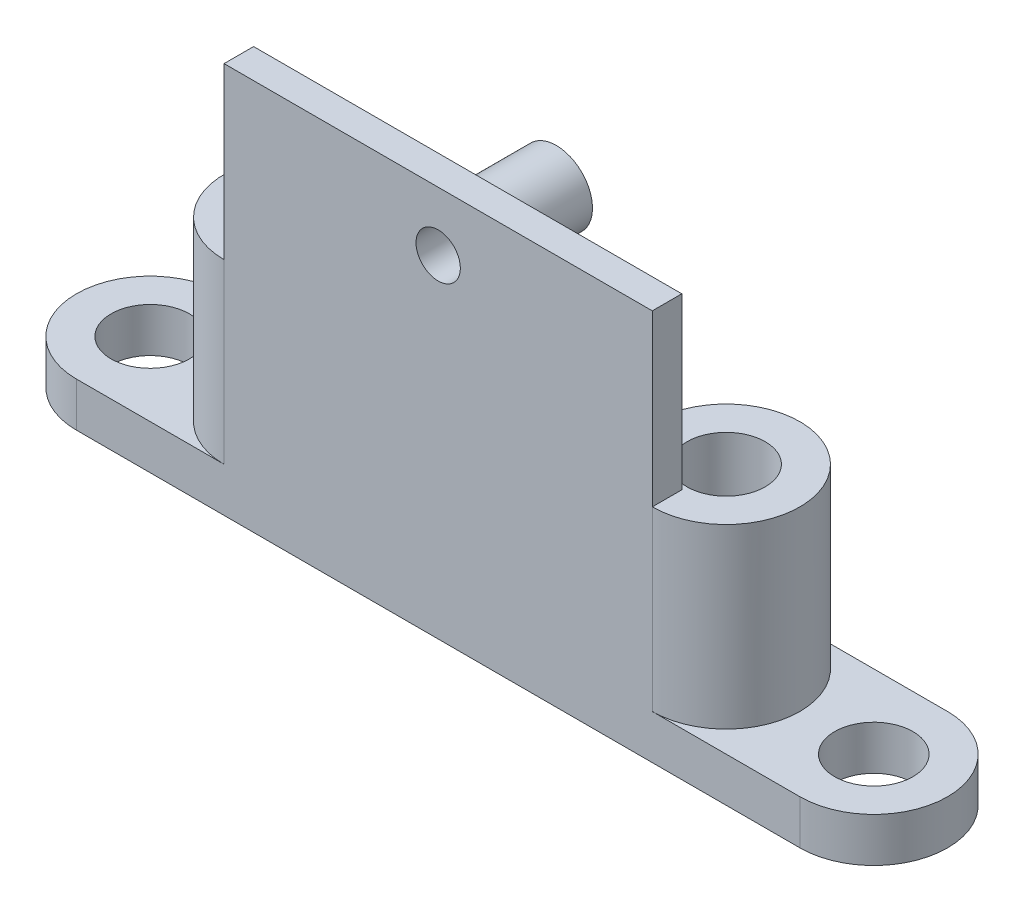
ISO-10303-21;
HEADER;
FILE_DESCRIPTION(('STEP AP214'),'2;1');
FILE_NAME('part.step','',(''),(''),'','','');
FILE_SCHEMA(('AUTOMOTIVE_DESIGN { 1 0 10303 214 1 1 1 1 }'));
ENDSEC;
DATA;
#1=APPLICATION_CONTEXT('core data for automotive mechanical design processes');
#2=APPLICATION_PROTOCOL_DEFINITION('international standard','automotive_design',2000,#1);
#3=PRODUCT_CONTEXT('',#1,'mechanical');
#4=PRODUCT('Part','Part','',(#3));
#5=PRODUCT_RELATED_PRODUCT_CATEGORY('part','',(#4));
#6=PRODUCT_DEFINITION_FORMATION('','',#4);
#7=PRODUCT_DEFINITION_CONTEXT('part definition',#1,'design');
#8=PRODUCT_DEFINITION('design','',#6,#7);
#9=PRODUCT_DEFINITION_SHAPE('','',#8);
#10=(LENGTH_UNIT() NAMED_UNIT(*) SI_UNIT(.MILLI.,.METRE.));
#11=(NAMED_UNIT(*) PLANE_ANGLE_UNIT() SI_UNIT($,.RADIAN.));
#12=(NAMED_UNIT(*) SI_UNIT($,.STERADIAN.) SOLID_ANGLE_UNIT());
#13=UNCERTAINTY_MEASURE_WITH_UNIT(LENGTH_MEASURE(1.E-05),#10,'distance_accuracy_value','');
#14=(GEOMETRIC_REPRESENTATION_CONTEXT(3) GLOBAL_UNCERTAINTY_ASSIGNED_CONTEXT((#13)) GLOBAL_UNIT_ASSIGNED_CONTEXT((#10,
#11,#12)) REPRESENTATION_CONTEXT('',''));
#15=CARTESIAN_POINT('',(0.,0.,0.));
#16=DIRECTION('',(0.,0.,1.));
#17=DIRECTION('',(1.,0.,0.));
#18=AXIS2_PLACEMENT_3D('',#15,#16,#17);
#19=CARTESIAN_POINT('',(5.00000000000012,10.,-5.));
#20=DIRECTION('',(0.,1.,0.));
#21=DIRECTION('',(0.,0.,1.));
#22=AXIS2_PLACEMENT_3D('',#19,#20,#21);
#23=PLANE('',#22);
#24=CARTESIAN_POINT('',(5.00000000000012,10.,-5.));
#25=DIRECTION('',(0.,-1.,0.));
#26=DIRECTION('',(0.,0.,1.));
#27=AXIS2_PLACEMENT_3D('',#24,#25,#26);
#28=CIRCLE('',#27,5.);
#29=CARTESIAN_POINT('',(5.00000000000012,10.,-10.));
#30=VERTEX_POINT('',#29);
#31=CARTESIAN_POINT('',(9.89897948556648,10.,-4.));
#32=VERTEX_POINT('',#31);
#33=EDGE_CURVE('E254',#30,#32,#28,.T.);
#34=ORIENTED_EDGE('',*,*,#33,.T.);
#35=DIRECTION('',(1.,0.,0.));
#36=VECTOR('',#35,1.);
#37=CARTESIAN_POINT('',(30.0000000000001,10.,-4.));
#38=LINE('',#37,#36);
#39=CARTESIAN_POINT('',(29.1010205144338,10.,-4.));
#40=VERTEX_POINT('',#39);
#41=EDGE_CURVE('E298',#32,#40,#38,.T.);
#42=ORIENTED_EDGE('',*,*,#41,.T.);
#43=CARTESIAN_POINT('',(34.0000000000001,10.,-5.));
#44=DIRECTION('',(0.,-1.,0.));
#45=DIRECTION('',(0.,0.,1.));
#46=AXIS2_PLACEMENT_3D('',#43,#44,#45);
#47=CIRCLE('',#46,5.);
#48=CARTESIAN_POINT('',(34.0000000000001,10.,-10.));
#49=VERTEX_POINT('',#48);
#50=EDGE_CURVE('E257',#40,#49,#47,.T.);
#51=ORIENTED_EDGE('',*,*,#50,.T.);
#52=DIRECTION('',(-1.,0.,0.));
#53=VECTOR('',#52,1.);
#54=CARTESIAN_POINT('',(5.00000000000012,10.,-10.));
#55=LINE('',#54,#53);
#56=EDGE_CURVE('E259',#49,#30,#55,.T.);
#57=ORIENTED_EDGE('',*,*,#56,.T.);
#58=EDGE_LOOP('',(#34,#42,#51,#57));
#59=FACE_BOUND('',#58,.T.);
#60=ADVANCED_FACE('F39',(#59),#23,.T.);
#61=CARTESIAN_POINT('',(34.0000000000001,15.,-5.));
#62=DIRECTION('',(0.,-1.,0.));
#63=DIRECTION('',(0.,0.,-1.));
#64=AXIS2_PLACEMENT_3D('',#61,#62,#63);
#65=CYLINDRICAL_SURFACE('',#64,5.);
#66=ORIENTED_EDGE('',*,*,#50,.F.);
#67=CARTESIAN_POINT('',(29.1010205144338,10.,-4.));
#68=CARTESIAN_POINT('',(29.1126902135662,9.99999307281817,-3.94278294499893));
#69=CARTESIAN_POINT('',(29.1253776267007,10.0024549159808,-3.88578862192964));
#70=CARTESIAN_POINT('',(29.1526214576939,10.0121509153291,-3.77269515352069));
#71=CARTESIAN_POINT('',(29.1671766959664,10.019382071384,-3.71659546811674));
#72=CARTESIAN_POINT('',(29.1979299396638,10.0384055503466,-3.60593746735619));
#73=CARTESIAN_POINT('',(29.2141196212744,10.0501755451099,-3.5513729881278));
#74=CARTESIAN_POINT('',(29.2479905125589,10.0780764625006,-3.44385465736229));
#75=CARTESIAN_POINT('',(29.2656719293214,10.0942079913009,-3.39090103084301));
#76=CARTESIAN_POINT('',(29.3205323872584,10.1487587882031,-3.23516726086207));
#77=CARTESIAN_POINT('',(29.3596264444344,10.193396195741,-3.13516458121287));
#78=CARTESIAN_POINT('',(29.4408392590147,10.2976812106451,-2.94455878628707));
#79=CARTESIAN_POINT('',(29.4829629370559,10.3573536497374,-2.85397157460503));
#80=CARTESIAN_POINT('',(29.5713339220482,10.4957844297533,-2.67674954081887));
#81=CARTESIAN_POINT('',(29.6176361817495,10.5757063940903,-2.59104755291779));
#82=CARTESIAN_POINT('',(29.7075491174569,10.7501227208773,-2.43425749110638));
#83=CARTESIAN_POINT('',(29.7511605231809,10.8446131080609,-2.36316544290965));
#84=CARTESIAN_POINT('',(29.8251643273312,11.0306003727889,-2.24778697309176));
#85=CARTESIAN_POINT('',(29.8565555378921,11.1201656478167,-2.20103286488032));
#86=CARTESIAN_POINT('',(29.9116882264867,11.3071664048664,-2.12109876649629));
#87=CARTESIAN_POINT('',(29.9354511971795,11.4045787899909,-2.08788056622036));
#88=CARTESIAN_POINT('',(29.9688564229424,11.584660118699,-2.04187205488796));
#89=CARTESIAN_POINT('',(29.980394866039,11.6662572508572,-2.0262898967322));
#90=CARTESIAN_POINT('',(29.9920824636055,11.7903309818029,-2.01057928644068));
#91=CARTESIAN_POINT('',(29.9950419897803,11.8320924229655,-2.00661927814956));
#92=CARTESIAN_POINT('',(29.999004261332,11.9158971864172,-2.00132726954565));
#93=CARTESIAN_POINT('',(30.0000058930954,11.9579406554861,-1.99999676484028));
#94=CARTESIAN_POINT('',(30.0000000000001,12.,-2.));
#95=B_SPLINE_CURVE_WITH_KNOTS('',3,(#67,#68,#69,#70,#71,#72,#73,#74,#75,#76,#77,#78,#79,#80,#81,
#82,#83,#84,#85,#86,#87,#88,#89,#90,#91,#92,#93,#94),.UNSPECIFIED.,.F.,.F.,(4,2,2,2,2,2,2,2,2,2,
2,2,2,4),(0.,0.175101370517457,0.350092698637755,0.52423394384886,0.698399403942051,
1.04563798829342,1.39345387180364,1.76978381212137,2.14601124493038,2.46215827511096,
2.77740657571168,3.02802320134718,3.15406643430614,3.28018133744859),.UNSPECIFIED.);
#96=CARTESIAN_POINT('',(30.0000000000001,12.,-2.));
#97=VERTEX_POINT('',#96);
#98=EDGE_CURVE('E67',#40,#97,#95,.T.);
#99=ORIENTED_EDGE('',*,*,#98,.T.);
#100=DIRECTION('',(0.,-1.,0.));
#101=VECTOR('',#100,1.);
#102=CARTESIAN_POINT('',(30.0000000000001,15.,-2.));
#103=LINE('',#102,#101);
#104=CARTESIAN_POINT('',(30.0000000000001,15.,-2.));
#105=VERTEX_POINT('',#104);
#106=EDGE_CURVE('E182',#97,#105,#103,.F.);
#107=ORIENTED_EDGE('',*,*,#106,.T.);
#108=CARTESIAN_POINT('',(34.0000000000001,15.,-5.));
#109=DIRECTION('',(0.,1.,0.));
#110=DIRECTION('',(0.,0.,1.));
#111=AXIS2_PLACEMENT_3D('',#108,#109,#110);
#112=CIRCLE('',#111,5.);
#113=CARTESIAN_POINT('',(34.0000000000001,15.,0.));
#114=VERTEX_POINT('',#113);
#115=EDGE_CURVE('E271',#114,#105,#112,.T.);
#116=ORIENTED_EDGE('',*,*,#115,.F.);
#117=DIRECTION('',(0.,-1.,0.));
#118=VECTOR('',#117,1.);
#119=CARTESIAN_POINT('',(34.0000000000001,15.,0.));
#120=LINE('',#119,#118);
#121=CARTESIAN_POINT('',(34.0000000000001,3.,0.));
#122=VERTEX_POINT('',#121);
#123=EDGE_CURVE('E278',#114,#122,#120,.T.);
#124=ORIENTED_EDGE('',*,*,#123,.T.);
#125=CARTESIAN_POINT('',(34.0000000000001,3.,-5.));
#126=DIRECTION('',(0.,-1.,0.));
#127=DIRECTION('',(0.,0.,-1.));
#128=AXIS2_PLACEMENT_3D('',#125,#126,#127);
#129=CIRCLE('',#128,5.);
#130=CARTESIAN_POINT('',(34.0000000000001,3.,-10.));
#131=VERTEX_POINT('',#130);
#132=EDGE_CURVE('E243',#131,#122,#129,.T.);
#133=ORIENTED_EDGE('',*,*,#132,.F.);
#134=DIRECTION('',(0.,-1.,0.));
#135=VECTOR('',#134,1.);
#136=CARTESIAN_POINT('',(34.0000000000001,15.,-10.));
#137=LINE('',#136,#135);
#138=EDGE_CURVE('E287',#49,#131,#137,.T.);
#139=ORIENTED_EDGE('',*,*,#138,.F.);
#140=EDGE_LOOP('',(#66,#99,#107,#116,#124,#133,#139));
#141=FACE_BOUND('',#140,.T.);
#142=ADVANCED_FACE('F305',(#141),#65,.T.);
#143=CARTESIAN_POINT('',(5.00000000000012,15.,-5.));
#144=DIRECTION('',(0.,-1.,0.));
#145=DIRECTION('',(0.,0.,-1.));
#146=AXIS2_PLACEMENT_3D('',#143,#144,#145);
#147=CYLINDRICAL_SURFACE('',#146,5.);
#148=DIRECTION('',(0.,-1.,0.));
#149=VECTOR('',#148,1.);
#150=CARTESIAN_POINT('',(9.00000000000012,15.,-2.));
#151=LINE('',#150,#149);
#152=CARTESIAN_POINT('',(9.00000000000012,15.,-2.));
#153=VERTEX_POINT('',#152);
#154=CARTESIAN_POINT('',(9.00000000000012,12.,-2.));
#155=VERTEX_POINT('',#154);
#156=EDGE_CURVE('E186',#153,#155,#151,.T.);
#157=ORIENTED_EDGE('',*,*,#156,.T.);
#158=CARTESIAN_POINT('',(9.00000000000012,12.,-2.));
#159=CARTESIAN_POINT('',(8.99998359957867,11.9501118086645,-1.99998912999715));
#160=CARTESIAN_POINT('',(9.00139950338209,11.9002339130368,-2.00186621290167));
#161=CARTESIAN_POINT('',(9.00697117565529,11.8009478282955,-2.00931094460478));
#162=CARTESIAN_POINT('',(9.01112471434834,11.7515392900896,-2.01487558993992));
#163=CARTESIAN_POINT('',(9.0220064150729,11.6539251721464,-2.02955522325891));
#164=CARTESIAN_POINT('',(9.02871507660948,11.605713356963,-2.03864332966506));
#165=CARTESIAN_POINT('',(9.04448850864633,11.5104582688436,-2.06022255242272));
#166=CARTESIAN_POINT('',(9.05355364955244,11.4634151808902,-2.07271420377912));
#167=CARTESIAN_POINT('',(9.08384132615853,11.32477470574,-2.11496224326767));
#168=CARTESIAN_POINT('',(9.10820217945941,11.2352823971424,-2.14955119611212));
#169=CARTESIAN_POINT('',(9.1630109805843,11.0635696843813,-2.23021457133599));
#170=CARTESIAN_POINT('',(9.1934708173822,10.9813639429227,-2.27631147058523));
#171=CARTESIAN_POINT('',(9.26171424848732,10.8168018979709,-2.38422352335028));
#172=CARTESIAN_POINT('',(9.29993349194095,10.7353873996464,-2.44719831808205));
#173=CARTESIAN_POINT('',(9.37840049696802,10.5836252938915,-2.58424865442774));
#174=CARTESIAN_POINT('',(9.41864941398518,10.5132840863005,-2.65833056749726));
#175=CARTESIAN_POINT('',(9.50525583892261,10.3743542697641,-2.82900863539251));
#176=CARTESIAN_POINT('',(9.55156859360123,10.3078171590678,-2.92731192248441));
#177=CARTESIAN_POINT('',(9.6406358204123,10.1927037814334,-3.13525515260118));
#178=CARTESIAN_POINT('',(9.68339432275204,10.144106950456,-3.24488193037178));
#179=CARTESIAN_POINT('',(9.75821917327529,10.0712504979287,-3.46025447044488));
#180=CARTESIAN_POINT('',(9.79094772412948,10.0448616604007,-3.56503951966061));
#181=CARTESIAN_POINT('',(9.83523885001318,10.0181351468716,-3.72579908375654));
#182=CARTESIAN_POINT('',(9.84922620584665,10.011368510852,-3.78009868430475));
#183=CARTESIAN_POINT('',(9.87545056064214,10.00229854344,-3.88952327754802));
#184=CARTESIAN_POINT('',(9.88768642333513,9.9999980974111,-3.94464878065877));
#185=CARTESIAN_POINT('',(9.89897948556648,10.,-4.));
#186=B_SPLINE_CURVE_WITH_KNOTS('',3,(#158,#159,#160,#161,#162,#163,#164,#165,#166,#167,#168,
#169,#170,#171,#172,#173,#174,#175,#176,#177,#178,#179,#180,#181,#182,#183,#184,#185),
.UNSPECIFIED.,.F.,.F.,(4,2,2,2,2,2,2,2,2,2,2,2,2,4),(0.,0.149592447049756,0.299063202836386,
0.447415355023448,0.595790840223872,0.891383802035521,1.18755868430084,1.51570729760843,
1.84404487449678,2.22451374151765,2.60454513206277,2.94164309833685,3.11089389563732,
3.28025400036889),.UNSPECIFIED.);
#187=EDGE_CURVE('E11',#155,#32,#186,.T.);
#188=ORIENTED_EDGE('',*,*,#187,.T.);
#189=ORIENTED_EDGE('',*,*,#33,.F.);
#190=DIRECTION('',(0.,-1.,0.));
#191=VECTOR('',#190,1.);
#192=CARTESIAN_POINT('',(5.00000000000012,15.,-10.));
#193=LINE('',#192,#191);
#194=CARTESIAN_POINT('',(5.00000000000012,3.,-10.));
#195=VERTEX_POINT('',#194);
#196=EDGE_CURVE('E285',#30,#195,#193,.T.);
#197=ORIENTED_EDGE('',*,*,#196,.T.);
#198=CARTESIAN_POINT('',(5.00000000000012,3.,-5.));
#199=DIRECTION('',(0.,-1.,0.));
#200=DIRECTION('',(0.,0.,-1.));
#201=AXIS2_PLACEMENT_3D('',#198,#199,#200);
#202=CIRCLE('',#201,5.);
#203=CARTESIAN_POINT('',(5.00000000000012,3.,0.));
#204=VERTEX_POINT('',#203);
#205=EDGE_CURVE('E290',#204,#195,#202,.T.);
#206=ORIENTED_EDGE('',*,*,#205,.F.);
#207=DIRECTION('',(0.,-1.,0.));
#208=VECTOR('',#207,1.);
#209=CARTESIAN_POINT('',(5.00000000000012,15.,0.));
#210=LINE('',#209,#208);
#211=CARTESIAN_POINT('',(5.00000000000012,15.,0.));
#212=VERTEX_POINT('',#211);
#213=EDGE_CURVE('E282',#212,#204,#210,.T.);
#214=ORIENTED_EDGE('',*,*,#213,.F.);
#215=CARTESIAN_POINT('',(5.00000000000012,15.,-5.));
#216=DIRECTION('',(0.,1.,0.));
#217=DIRECTION('',(0.,0.,1.));
#218=AXIS2_PLACEMENT_3D('',#215,#216,#217);
#219=CIRCLE('',#218,5.);
#220=EDGE_CURVE('E274',#153,#212,#219,.T.);
#221=ORIENTED_EDGE('',*,*,#220,.F.);
#222=EDGE_LOOP('',(#157,#188,#189,#197,#206,#214,#221));
#223=FACE_BOUND('',#222,.T.);
#224=ADVANCED_FACE('F309',(#223),#147,.T.);
#225=CARTESIAN_POINT('',(34.0000000000001,15.,-5.));
#226=DIRECTION('',(0.,1.,0.));
#227=DIRECTION('',(0.,0.,1.));
#228=AXIS2_PLACEMENT_3D('',#225,#226,#227);
#229=PLANE('',#228);
#230=DIRECTION('',(0.,0.,1.));
#231=VECTOR('',#230,1.);
#232=CARTESIAN_POINT('',(5.00000000000012,15.,-5.));
#233=LINE('',#232,#231);
#234=CARTESIAN_POINT('',(5.00000000000012,15.,-2.));
#235=VERTEX_POINT('',#234);
#236=EDGE_CURVE('E188',#235,#212,#233,.T.);
#237=ORIENTED_EDGE('',*,*,#236,.F.);
#238=DIRECTION('',(-1.,0.,0.));
#239=VECTOR('',#238,1.);
#240=CARTESIAN_POINT('',(34.0000000000001,15.,-2.));
#241=LINE('',#240,#239);
#242=EDGE_CURVE('E184',#153,#235,#241,.T.);
#243=ORIENTED_EDGE('',*,*,#242,.F.);
#244=ORIENTED_EDGE('',*,*,#220,.T.);
#245=EDGE_LOOP('',(#237,#243,#244));
#246=FACE_BOUND('',#245,.T.);
#247=CARTESIAN_POINT('',(5.00000000000012,15.,-5.));
#248=DIRECTION('',(0.,1.,0.));
#249=DIRECTION('',(0.,0.,1.));
#250=AXIS2_PLACEMENT_3D('',#247,#248,#249);
#251=CIRCLE('',#250,2.65);
#252=CARTESIAN_POINT('',(5.00000000000012,15.,-2.35));
#253=VERTEX_POINT('',#252);
#254=EDGE_CURVE('E266',#253,#253,#251,.T.);
#255=ORIENTED_EDGE('',*,*,#254,.F.);
#256=EDGE_LOOP('',(#255));
#257=FACE_BOUND('',#256,.T.);
#258=ADVANCED_FACE('F313',(#246,#257),#229,.T.);
#259=CARTESIAN_POINT('',(5.00000000000012,15.,-10.));
#260=DIRECTION('',(0.,0.,1.));
#261=DIRECTION('',(1.,0.,0.));
#262=AXIS2_PLACEMENT_3D('',#259,#260,#261);
#263=PLANE('',#262);
#264=DIRECTION('',(-1.,0.,0.));
#265=VECTOR('',#264,1.);
#266=CARTESIAN_POINT('',(5.00000000000012,0.,-10.));
#267=LINE('',#266,#265);
#268=CARTESIAN_POINT('',(44.0018614213481,0.,-10.));
#269=VERTEX_POINT('',#268);
#270=CARTESIAN_POINT('',(-5.00186142134788,0.,-10.));
#271=VERTEX_POINT('',#270);
#272=EDGE_CURVE('E270',#269,#271,#267,.T.);
#273=ORIENTED_EDGE('',*,*,#272,.T.);
#274=DIRECTION('',(0.,-1.,0.));
#275=VECTOR('',#274,1.);
#276=CARTESIAN_POINT('',(-5.00186142134788,3.,-10.));
#277=LINE('',#276,#275);
#278=CARTESIAN_POINT('',(-5.00186142134788,3.,-10.));
#279=VERTEX_POINT('',#278);
#280=EDGE_CURVE('E244',#279,#271,#277,.T.);
#281=ORIENTED_EDGE('',*,*,#280,.F.);
#282=DIRECTION('',(1.,0.,0.));
#283=VECTOR('',#282,1.);
#284=CARTESIAN_POINT('',(44.0018614213481,3.,-10.));
#285=LINE('',#284,#283);
#286=EDGE_CURVE('E232',#279,#195,#285,.T.);
#287=ORIENTED_EDGE('',*,*,#286,.T.);
#288=ORIENTED_EDGE('',*,*,#196,.F.);
#289=ORIENTED_EDGE('',*,*,#56,.F.);
#290=ORIENTED_EDGE('',*,*,#138,.T.);
#291=CARTESIAN_POINT('',(44.0018614213481,3.,-10.));
#292=VERTEX_POINT('',#291);
#293=EDGE_CURVE('E231',#131,#292,#285,.T.);
#294=ORIENTED_EDGE('',*,*,#293,.T.);
#295=DIRECTION('',(0.,-1.,0.));
#296=VECTOR('',#295,1.);
#297=CARTESIAN_POINT('',(44.0018614213481,3.,-10.));
#298=LINE('',#297,#296);
#299=EDGE_CURVE('E240',#292,#269,#298,.T.);
#300=ORIENTED_EDGE('',*,*,#299,.T.);
#301=EDGE_LOOP('',(#273,#281,#287,#288,#289,#290,#294,#300));
#302=FACE_BOUND('',#301,.T.);
#303=ADVANCED_FACE('F310',(#302),#263,.F.);
#304=CARTESIAN_POINT('',(5.00000000000012,15.,0.));
#305=DIRECTION('',(0.,0.,-1.));
#306=DIRECTION('',(-1.,0.,0.));
#307=AXIS2_PLACEMENT_3D('',#304,#305,#306);
#308=PLANE('',#307);
#309=ORIENTED_EDGE('',*,*,#123,.F.);
#310=DIRECTION('',(0.,1.,0.));
#311=VECTOR('',#310,1.);
#312=CARTESIAN_POINT('',(34.0000000000001,10.,0.));
#313=LINE('',#312,#311);
#314=CARTESIAN_POINT('',(34.0000000000001,26.5,0.));
#315=VERTEX_POINT('',#314);
#316=EDGE_CURVE('E174',#114,#315,#313,.T.);
#317=ORIENTED_EDGE('',*,*,#316,.T.);
#318=DIRECTION('',(1.,0.,0.));
#319=VECTOR('',#318,1.);
#320=CARTESIAN_POINT('',(29.5000000000001,26.5,0.));
#321=LINE('',#320,#319);
#322=CARTESIAN_POINT('',(5.00000000000012,26.5,0.));
#323=VERTEX_POINT('',#322);
#324=EDGE_CURVE('E161',#323,#315,#321,.T.);
#325=ORIENTED_EDGE('',*,*,#324,.F.);
#326=DIRECTION('',(0.,-1.,0.));
#327=VECTOR('',#326,1.);
#328=CARTESIAN_POINT('',(5.00000000000012,10.,0.));
#329=LINE('',#328,#327);
#330=EDGE_CURVE('E171',#323,#212,#329,.T.);
#331=ORIENTED_EDGE('',*,*,#330,.T.);
#332=ORIENTED_EDGE('',*,*,#213,.T.);
#333=DIRECTION('',(-1.,0.,0.));
#334=VECTOR('',#333,1.);
#335=CARTESIAN_POINT('',(44.0018614213481,3.,0.));
#336=LINE('',#335,#334);
#337=CARTESIAN_POINT('',(-5.00186142134788,3.,0.));
#338=VERTEX_POINT('',#337);
#339=EDGE_CURVE('E223',#204,#338,#336,.T.);
#340=ORIENTED_EDGE('',*,*,#339,.T.);
#341=DIRECTION('',(0.,-1.,0.));
#342=VECTOR('',#341,1.);
#343=CARTESIAN_POINT('',(-5.00186142134788,3.,0.));
#344=LINE('',#343,#342);
#345=CARTESIAN_POINT('',(-5.00186142134788,0.,0.));
#346=VERTEX_POINT('',#345);
#347=EDGE_CURVE('E247',#338,#346,#344,.T.);
#348=ORIENTED_EDGE('',*,*,#347,.T.);
#349=DIRECTION('',(1.,0.,0.));
#350=VECTOR('',#349,1.);
#351=CARTESIAN_POINT('',(5.00000000000012,0.,0.));
#352=LINE('',#351,#350);
#353=CARTESIAN_POINT('',(44.0018614213481,0.,0.));
#354=VERTEX_POINT('',#353);
#355=EDGE_CURVE('E275',#346,#354,#352,.T.);
#356=ORIENTED_EDGE('',*,*,#355,.T.);
#357=DIRECTION('',(0.,-1.,0.));
#358=VECTOR('',#357,1.);
#359=CARTESIAN_POINT('',(44.0018614213481,3.,0.));
#360=LINE('',#359,#358);
#361=CARTESIAN_POINT('',(44.0018614213481,3.,0.));
#362=VERTEX_POINT('',#361);
#363=EDGE_CURVE('E235',#362,#354,#360,.T.);
#364=ORIENTED_EDGE('',*,*,#363,.F.);
#365=EDGE_CURVE('E225',#362,#122,#336,.T.);
#366=ORIENTED_EDGE('',*,*,#365,.T.);
#367=EDGE_LOOP('',(#309,#317,#325,#331,#332,#340,#348,#356,#364,#366));
#368=FACE_BOUND('',#367,.T.);
#369=CARTESIAN_POINT('',(19.5000000000001,22.5,0.));
#370=DIRECTION('',(0.,0.,-1.));
#371=DIRECTION('',(-1.,0.,0.));
#372=AXIS2_PLACEMENT_3D('',#369,#370,#371);
#373=CIRCLE('',#372,1.5);
#374=CARTESIAN_POINT('',(18.0000000000001,22.5,0.));
#375=VERTEX_POINT('',#374);
#376=EDGE_CURVE('E191',#375,#375,#373,.T.);
#377=ORIENTED_EDGE('',*,*,#376,.T.);
#378=EDGE_LOOP('',(#377));
#379=FACE_BOUND('',#378,.T.);
#380=ADVANCED_FACE('F312',(#368,#379),#308,.F.);
#381=CARTESIAN_POINT('',(34.0000000000001,15.,-5.));
#382=DIRECTION('',(0.,-1.,0.));
#383=DIRECTION('',(0.,0.,-1.));
#384=AXIS2_PLACEMENT_3D('',#381,#382,#383);
#385=CYLINDRICAL_SURFACE('',#384,2.65);
#386=CARTESIAN_POINT('',(34.0000000000001,15.,-5.));
#387=DIRECTION('',(0.,1.,0.));
#388=DIRECTION('',(0.,0.,1.));
#389=AXIS2_PLACEMENT_3D('',#386,#387,#388);
#390=CIRCLE('',#389,2.65);
#391=CARTESIAN_POINT('',(34.0000000000001,15.,-2.35));
#392=VERTEX_POINT('',#391);
#393=EDGE_CURVE('E263',#392,#392,#390,.T.);
#394=ORIENTED_EDGE('',*,*,#393,.T.);
#395=EDGE_LOOP('',(#394));
#396=FACE_BOUND('',#395,.T.);
#397=CARTESIAN_POINT('',(34.0000000000001,4.,-5.));
#398=DIRECTION('',(0.,-1.,0.));
#399=DIRECTION('',(0.,0.,-1.));
#400=AXIS2_PLACEMENT_3D('',#397,#398,#399);
#401=CIRCLE('',#400,2.65);
#402=CARTESIAN_POINT('',(34.0000000000001,4.,-7.65));
#403=VERTEX_POINT('',#402);
#404=EDGE_CURVE('E262',#403,#403,#401,.T.);
#405=ORIENTED_EDGE('',*,*,#404,.T.);
#406=EDGE_LOOP('',(#405));
#407=FACE_BOUND('',#406,.T.);
#408=ADVANCED_FACE('F321',(#396,#407),#385,.F.);
#409=CARTESIAN_POINT('',(5.00000000000012,15.,-5.));
#410=DIRECTION('',(0.,-1.,0.));
#411=DIRECTION('',(0.,0.,-1.));
#412=AXIS2_PLACEMENT_3D('',#409,#410,#411);
#413=CYLINDRICAL_SURFACE('',#412,2.65);
#414=ORIENTED_EDGE('',*,*,#254,.T.);
#415=EDGE_LOOP('',(#414));
#416=FACE_BOUND('',#415,.T.);
#417=CARTESIAN_POINT('',(5.00000000000012,4.,-5.));
#418=DIRECTION('',(0.,-1.,0.));
#419=DIRECTION('',(0.,0.,-1.));
#420=AXIS2_PLACEMENT_3D('',#417,#418,#419);
#421=CIRCLE('',#420,2.65);
#422=CARTESIAN_POINT('',(5.00000000000012,4.,-7.65));
#423=VERTEX_POINT('',#422);
#424=EDGE_CURVE('E267',#423,#423,#421,.T.);
#425=ORIENTED_EDGE('',*,*,#424,.T.);
#426=EDGE_LOOP('',(#425));
#427=FACE_BOUND('',#426,.T.);
#428=ADVANCED_FACE('F331',(#416,#427),#413,.F.);
#429=DIRECTION('',(0.,0.,-1.));
#430=VECTOR('',#429,1.);
#431=CARTESIAN_POINT('',(34.0000000000001,15.,-5.));
#432=LINE('',#431,#430);
#433=CARTESIAN_POINT('',(34.0000000000001,15.,-2.));
#434=VERTEX_POINT('',#433);
#435=EDGE_CURVE('E150',#114,#434,#432,.T.);
#436=ORIENTED_EDGE('',*,*,#435,.F.);
#437=ORIENTED_EDGE('',*,*,#115,.T.);
#438=DIRECTION('',(-1.,0.,0.));
#439=VECTOR('',#438,1.);
#440=CARTESIAN_POINT('',(34.0000000000001,15.,-2.));
#441=LINE('',#440,#439);
#442=EDGE_CURVE('E180',#434,#105,#441,.T.);
#443=ORIENTED_EDGE('',*,*,#442,.F.);
#444=EDGE_LOOP('',(#436,#437,#443));
#445=FACE_BOUND('',#444,.T.);
#446=ORIENTED_EDGE('',*,*,#393,.F.);
#447=EDGE_LOOP('',(#446));
#448=FACE_BOUND('',#447,.T.);
#449=ADVANCED_FACE('F327',(#445,#448),#229,.T.);
#450=CARTESIAN_POINT('',(34.0000000000001,0.,-5.));
#451=DIRECTION('',(0.,1.,0.));
#452=DIRECTION('',(0.,0.,1.));
#453=AXIS2_PLACEMENT_3D('',#450,#451,#452);
#454=PLANE('',#453);
#455=ORIENTED_EDGE('',*,*,#272,.F.);
#456=CARTESIAN_POINT('',(44.0018614213481,0.,-5.));
#457=DIRECTION('',(0.,-1.,0.));
#458=DIRECTION('',(0.,0.,-1.));
#459=AXIS2_PLACEMENT_3D('',#456,#457,#458);
#460=CIRCLE('',#459,5.);
#461=EDGE_CURVE('E217',#269,#354,#460,.T.);
#462=ORIENTED_EDGE('',*,*,#461,.T.);
#463=ORIENTED_EDGE('',*,*,#355,.F.);
#464=CARTESIAN_POINT('',(-5.00186142134788,0.,-5.));
#465=DIRECTION('',(0.,-1.,0.));
#466=DIRECTION('',(0.,0.,-1.));
#467=AXIS2_PLACEMENT_3D('',#464,#465,#466);
#468=CIRCLE('',#467,5.);
#469=EDGE_CURVE('E224',#346,#271,#468,.T.);
#470=ORIENTED_EDGE('',*,*,#469,.T.);
#471=EDGE_LOOP('',(#455,#462,#463,#470));
#472=FACE_BOUND('',#471,.T.);
#473=CARTESIAN_POINT('',(-5.00186142134788,0.,-5.));
#474=DIRECTION('',(0.,-1.,0.));
#475=DIRECTION('',(0.,0.,-1.));
#476=AXIS2_PLACEMENT_3D('',#473,#474,#475);
#477=CIRCLE('',#476,2.65);
#478=CARTESIAN_POINT('',(-5.00186142134788,0.,-7.65));
#479=VERTEX_POINT('',#478);
#480=EDGE_CURVE('E211',#479,#479,#477,.T.);
#481=ORIENTED_EDGE('',*,*,#480,.F.);
#482=EDGE_LOOP('',(#481));
#483=FACE_BOUND('',#482,.T.);
#484=CARTESIAN_POINT('',(44.0018614213481,0.,-5.));
#485=DIRECTION('',(0.,-1.,0.));
#486=DIRECTION('',(0.,0.,-1.));
#487=AXIS2_PLACEMENT_3D('',#484,#485,#486);
#488=CIRCLE('',#487,2.65000000000001);
#489=CARTESIAN_POINT('',(44.0018614213481,0.,-7.65000000000001));
#490=VERTEX_POINT('',#489);
#491=EDGE_CURVE('E207',#490,#490,#488,.T.);
#492=ORIENTED_EDGE('',*,*,#491,.F.);
#493=EDGE_LOOP('',(#492));
#494=FACE_BOUND('',#493,.T.);
#495=ADVANCED_FACE('F323',(#472,#483,#494),#454,.F.);
#496=CARTESIAN_POINT('',(5.00000000000012,4.,-5.));
#497=DIRECTION('',(0.,-1.,0.));
#498=DIRECTION('',(0.,0.,-1.));
#499=AXIS2_PLACEMENT_3D('',#496,#497,#498);
#500=PLANE('',#499);
#501=ORIENTED_EDGE('',*,*,#424,.F.);
#502=EDGE_LOOP('',(#501));
#503=FACE_BOUND('',#502,.T.);
#504=ADVANCED_FACE('F326',(#503),#500,.F.);
#505=CARTESIAN_POINT('',(34.0000000000001,4.,-5.));
#506=DIRECTION('',(0.,-1.,0.));
#507=DIRECTION('',(0.,0.,-1.));
#508=AXIS2_PLACEMENT_3D('',#505,#506,#507);
#509=PLANE('',#508);
#510=ORIENTED_EDGE('',*,*,#404,.F.);
#511=EDGE_LOOP('',(#510));
#512=FACE_BOUND('',#511,.T.);
#513=ADVANCED_FACE('F341',(#512),#509,.F.);
#514=CARTESIAN_POINT('',(-5.00186142134788,3.,-5.));
#515=DIRECTION('',(0.,-1.,0.));
#516=DIRECTION('',(0.,0.,-1.));
#517=AXIS2_PLACEMENT_3D('',#514,#515,#516);
#518=CYLINDRICAL_SURFACE('',#517,2.65);
#519=CARTESIAN_POINT('',(-5.00186142134788,3.,-5.));
#520=DIRECTION('',(0.,-1.,0.));
#521=DIRECTION('',(0.,0.,-1.));
#522=AXIS2_PLACEMENT_3D('',#519,#520,#521);
#523=CIRCLE('',#522,2.65);
#524=CARTESIAN_POINT('',(-5.00186142134788,3.,-7.65));
#525=VERTEX_POINT('',#524);
#526=EDGE_CURVE('E214',#525,#525,#523,.T.);
#527=ORIENTED_EDGE('',*,*,#526,.F.);
#528=EDGE_LOOP('',(#527));
#529=FACE_BOUND('',#528,.T.);
#530=ORIENTED_EDGE('',*,*,#480,.T.);
#531=EDGE_LOOP('',(#530));
#532=FACE_BOUND('',#531,.T.);
#533=ADVANCED_FACE('F345',(#529,#532),#518,.F.);
#534=CARTESIAN_POINT('',(-5.00186142134788,3.,-5.));
#535=DIRECTION('',(0.,-1.,0.));
#536=DIRECTION('',(0.,0.,-1.));
#537=AXIS2_PLACEMENT_3D('',#534,#535,#536);
#538=CYLINDRICAL_SURFACE('',#537,5.);
#539=ORIENTED_EDGE('',*,*,#469,.F.);
#540=ORIENTED_EDGE('',*,*,#347,.F.);
#541=CARTESIAN_POINT('',(-5.00186142134788,3.,-5.));
#542=DIRECTION('',(0.,-1.,0.));
#543=DIRECTION('',(0.,0.,-1.));
#544=AXIS2_PLACEMENT_3D('',#541,#542,#543);
#545=CIRCLE('',#544,5.);
#546=EDGE_CURVE('E228',#338,#279,#545,.T.);
#547=ORIENTED_EDGE('',*,*,#546,.T.);
#548=ORIENTED_EDGE('',*,*,#280,.T.);
#549=EDGE_LOOP('',(#539,#540,#547,#548));
#550=FACE_BOUND('',#549,.T.);
#551=ADVANCED_FACE('F356',(#550),#538,.T.);
#552=CARTESIAN_POINT('',(44.0018614213481,3.,-5.));
#553=DIRECTION('',(0.,-1.,0.));
#554=DIRECTION('',(0.,0.,-1.));
#555=AXIS2_PLACEMENT_3D('',#552,#553,#554);
#556=PLANE('',#555);
#557=ORIENTED_EDGE('',*,*,#526,.T.);
#558=EDGE_LOOP('',(#557));
#559=FACE_BOUND('',#558,.T.);
#560=ORIENTED_EDGE('',*,*,#339,.F.);
#561=ORIENTED_EDGE('',*,*,#205,.T.);
#562=ORIENTED_EDGE('',*,*,#286,.F.);
#563=ORIENTED_EDGE('',*,*,#546,.F.);
#564=EDGE_LOOP('',(#560,#561,#562,#563));
#565=FACE_BOUND('',#564,.T.);
#566=ADVANCED_FACE('F359',(#559,#565),#556,.F.);
#567=CARTESIAN_POINT('',(44.0018614213481,3.,-5.));
#568=DIRECTION('',(0.,-1.,0.));
#569=DIRECTION('',(0.,0.,-1.));
#570=AXIS2_PLACEMENT_3D('',#567,#568,#569);
#571=CIRCLE('',#570,2.65000000000001);
#572=CARTESIAN_POINT('',(44.0018614213481,3.,-7.65000000000001));
#573=VERTEX_POINT('',#572);
#574=EDGE_CURVE('E208',#573,#573,#571,.T.);
#575=ORIENTED_EDGE('',*,*,#574,.T.);
#576=EDGE_LOOP('',(#575));
#577=FACE_BOUND('',#576,.T.);
#578=ORIENTED_EDGE('',*,*,#293,.F.);
#579=ORIENTED_EDGE('',*,*,#132,.T.);
#580=ORIENTED_EDGE('',*,*,#365,.F.);
#581=CARTESIAN_POINT('',(44.0018614213481,3.,-5.));
#582=DIRECTION('',(0.,-1.,0.));
#583=DIRECTION('',(0.,0.,-1.));
#584=AXIS2_PLACEMENT_3D('',#581,#582,#583);
#585=CIRCLE('',#584,5.);
#586=EDGE_CURVE('E220',#292,#362,#585,.T.);
#587=ORIENTED_EDGE('',*,*,#586,.F.);
#588=EDGE_LOOP('',(#578,#579,#580,#587));
#589=FACE_BOUND('',#588,.T.);
#590=ADVANCED_FACE('F354',(#577,#589),#556,.F.);
#591=CARTESIAN_POINT('',(44.0018614213481,3.,-5.));
#592=DIRECTION('',(0.,-1.,0.));
#593=DIRECTION('',(0.,0.,-1.));
#594=AXIS2_PLACEMENT_3D('',#591,#592,#593);
#595=CYLINDRICAL_SURFACE('',#594,5.);
#596=ORIENTED_EDGE('',*,*,#461,.F.);
#597=ORIENTED_EDGE('',*,*,#299,.F.);
#598=ORIENTED_EDGE('',*,*,#586,.T.);
#599=ORIENTED_EDGE('',*,*,#363,.T.);
#600=EDGE_LOOP('',(#596,#597,#598,#599));
#601=FACE_BOUND('',#600,.T.);
#602=ADVANCED_FACE('F350',(#601),#595,.T.);
#603=CARTESIAN_POINT('',(44.0018614213481,3.,-5.));
#604=DIRECTION('',(0.,-1.,0.));
#605=DIRECTION('',(0.,0.,-1.));
#606=AXIS2_PLACEMENT_3D('',#603,#604,#605);
#607=CYLINDRICAL_SURFACE('',#606,2.65000000000001);
#608=ORIENTED_EDGE('',*,*,#574,.F.);
#609=EDGE_LOOP('',(#608));
#610=FACE_BOUND('',#609,.T.);
#611=ORIENTED_EDGE('',*,*,#491,.T.);
#612=EDGE_LOOP('',(#611));
#613=FACE_BOUND('',#612,.T.);
#614=ADVANCED_FACE('F353',(#610,#613),#607,.F.);
#615=CARTESIAN_POINT('',(0.,26.5,0.));
#616=DIRECTION('',(0.,-1.,0.));
#617=DIRECTION('',(0.,0.,-1.));
#618=AXIS2_PLACEMENT_3D('',#615,#616,#617);
#619=PLANE('',#618);
#620=ORIENTED_EDGE('',*,*,#324,.T.);
#621=DIRECTION('',(0.,0.,1.));
#622=VECTOR('',#621,1.);
#623=CARTESIAN_POINT('',(34.0000000000001,26.5,-2.));
#624=LINE('',#623,#622);
#625=CARTESIAN_POINT('',(34.0000000000001,26.5,-2.));
#626=VERTEX_POINT('',#625);
#627=EDGE_CURVE('E148',#626,#315,#624,.T.);
#628=ORIENTED_EDGE('',*,*,#627,.F.);
#629=DIRECTION('',(-1.,0.,0.));
#630=VECTOR('',#629,1.);
#631=CARTESIAN_POINT('',(5.00000000000012,26.5,-2.));
#632=LINE('',#631,#630);
#633=CARTESIAN_POINT('',(5.00000000000012,26.5,-2.));
#634=VERTEX_POINT('',#633);
#635=EDGE_CURVE('E154',#626,#634,#632,.T.);
#636=ORIENTED_EDGE('',*,*,#635,.T.);
#637=DIRECTION('',(0.,0.,1.));
#638=VECTOR('',#637,1.);
#639=CARTESIAN_POINT('',(5.00000000000012,26.5,-2.));
#640=LINE('',#639,#638);
#641=EDGE_CURVE('E163',#634,#323,#640,.T.);
#642=ORIENTED_EDGE('',*,*,#641,.T.);
#643=EDGE_LOOP('',(#620,#628,#636,#642));
#644=FACE_BOUND('',#643,.T.);
#645=ADVANCED_FACE('F159',(#644),#619,.F.);
#646=CARTESIAN_POINT('',(19.5000000000001,22.5,-2.5));
#647=DIRECTION('',(0.,0.,1.));
#648=DIRECTION('',(1.,0.,0.));
#649=AXIS2_PLACEMENT_3D('',#646,#647,#648);
#650=CYLINDRICAL_SURFACE('',#649,3.5);
#651=CARTESIAN_POINT('',(19.5000000000001,22.5,-2.));
#652=DIRECTION('',(0.,0.,-1.));
#653=DIRECTION('',(-1.,0.,0.));
#654=AXIS2_PLACEMENT_3D('',#651,#652,#653);
#655=CIRCLE('',#654,3.5);
#656=CARTESIAN_POINT('',(16.0000000000001,22.5,-2.));
#657=VERTEX_POINT('',#656);
#658=EDGE_CURVE('E176',#657,#657,#655,.T.);
#659=ORIENTED_EDGE('',*,*,#658,.T.);
#660=EDGE_LOOP('',(#659));
#661=FACE_BOUND('',#660,.T.);
#662=CARTESIAN_POINT('',(19.5000000000001,22.5,-2.5));
#663=DIRECTION('',(0.,0.,-1.));
#664=DIRECTION('',(-1.,0.,0.));
#665=AXIS2_PLACEMENT_3D('',#662,#663,#664);
#666=CIRCLE('',#665,3.5);
#667=CARTESIAN_POINT('',(16.0000000000001,22.5,-2.5));
#668=VERTEX_POINT('',#667);
#669=EDGE_CURVE('E194',#668,#668,#666,.T.);
#670=ORIENTED_EDGE('',*,*,#669,.F.);
#671=EDGE_LOOP('',(#670));
#672=FACE_BOUND('',#671,.T.);
#673=ADVANCED_FACE('F385',(#661,#672),#650,.T.);
#674=CARTESIAN_POINT('',(19.5000000000001,22.5,-2.5));
#675=DIRECTION('',(0.,0.,-1.));
#676=DIRECTION('',(-1.,0.,0.));
#677=AXIS2_PLACEMENT_3D('',#674,#675,#676);
#678=PLANE('',#677);
#679=CARTESIAN_POINT('',(19.5000000000001,22.5,-2.5));
#680=DIRECTION('',(0.,0.,-1.));
#681=DIRECTION('',(-1.,0.,0.));
#682=AXIS2_PLACEMENT_3D('',#679,#680,#681);
#683=CIRCLE('',#682,2.45);
#684=CARTESIAN_POINT('',(17.0500000000001,22.5,-2.5));
#685=VERTEX_POINT('',#684);
#686=EDGE_CURVE('E197',#685,#685,#683,.T.);
#687=ORIENTED_EDGE('',*,*,#686,.F.);
#688=EDGE_LOOP('',(#687));
#689=FACE_BOUND('',#688,.T.);
#690=ORIENTED_EDGE('',*,*,#669,.T.);
#691=EDGE_LOOP('',(#690));
#692=FACE_BOUND('',#691,.T.);
#693=ADVANCED_FACE('F374',(#689,#692),#678,.T.);
#694=CARTESIAN_POINT('',(19.5000000000001,22.5,-8.));
#695=DIRECTION('',(0.,0.,1.));
#696=DIRECTION('',(1.,0.,0.));
#697=AXIS2_PLACEMENT_3D('',#694,#695,#696);
#698=CYLINDRICAL_SURFACE('',#697,2.45);
#699=ORIENTED_EDGE('',*,*,#686,.T.);
#700=EDGE_LOOP('',(#699));
#701=FACE_BOUND('',#700,.T.);
#702=CARTESIAN_POINT('',(19.5000000000001,22.5,-8.));
#703=DIRECTION('',(0.,0.,-1.));
#704=DIRECTION('',(-1.,0.,0.));
#705=AXIS2_PLACEMENT_3D('',#702,#703,#704);
#706=CIRCLE('',#705,2.45);
#707=CARTESIAN_POINT('',(17.0500000000001,22.5,-8.));
#708=VERTEX_POINT('',#707);
#709=EDGE_CURVE('E204',#708,#708,#706,.T.);
#710=ORIENTED_EDGE('',*,*,#709,.F.);
#711=EDGE_LOOP('',(#710));
#712=FACE_BOUND('',#711,.T.);
#713=ADVANCED_FACE('F370',(#701,#712),#698,.T.);
#714=CARTESIAN_POINT('',(19.5000000000001,22.5,-8.));
#715=DIRECTION('',(0.,0.,-1.));
#716=DIRECTION('',(-1.,0.,0.));
#717=AXIS2_PLACEMENT_3D('',#714,#715,#716);
#718=PLANE('',#717);
#719=ORIENTED_EDGE('',*,*,#709,.T.);
#720=EDGE_LOOP('',(#719));
#721=FACE_BOUND('',#720,.T.);
#722=CARTESIAN_POINT('',(19.5000000000001,22.5,-8.));
#723=DIRECTION('',(0.,0.,-1.));
#724=DIRECTION('',(-1.,0.,0.));
#725=AXIS2_PLACEMENT_3D('',#722,#723,#724);
#726=CIRCLE('',#725,1.5);
#727=CARTESIAN_POINT('',(18.0000000000001,22.5,-8.));
#728=VERTEX_POINT('',#727);
#729=EDGE_CURVE('E201',#728,#728,#726,.T.);
#730=ORIENTED_EDGE('',*,*,#729,.F.);
#731=EDGE_LOOP('',(#730));
#732=FACE_BOUND('',#731,.T.);
#733=ADVANCED_FACE('F373',(#721,#732),#718,.T.);
#734=CARTESIAN_POINT('',(19.5000000000001,22.5,-8.));
#735=DIRECTION('',(0.,0.,1.));
#736=DIRECTION('',(1.,0.,0.));
#737=AXIS2_PLACEMENT_3D('',#734,#735,#736);
#738=CYLINDRICAL_SURFACE('',#737,1.5);
#739=ORIENTED_EDGE('',*,*,#729,.T.);
#740=EDGE_LOOP('',(#739));
#741=FACE_BOUND('',#740,.T.);
#742=ORIENTED_EDGE('',*,*,#376,.F.);
#743=EDGE_LOOP('',(#742));
#744=FACE_BOUND('',#743,.T.);
#745=ADVANCED_FACE('F378',(#741,#744),#738,.F.);
#746=CARTESIAN_POINT('',(0.,0.,-2.));
#747=DIRECTION('',(0.,0.,-1.));
#748=DIRECTION('',(-1.,0.,0.));
#749=AXIS2_PLACEMENT_3D('',#746,#747,#748);
#750=PLANE('',#749);
#751=ORIENTED_EDGE('',*,*,#658,.F.);
#752=EDGE_LOOP('',(#751));
#753=FACE_BOUND('',#752,.T.);
#754=ORIENTED_EDGE('',*,*,#106,.F.);
#755=DIRECTION('',(1.,0.,0.));
#756=VECTOR('',#755,1.);
#757=CARTESIAN_POINT('',(9.00000000000012,12.,-2.));
#758=LINE('',#757,#756);
#759=EDGE_CURVE('E53',#97,#155,#758,.F.);
#760=ORIENTED_EDGE('',*,*,#759,.T.);
#761=ORIENTED_EDGE('',*,*,#156,.F.);
#762=ORIENTED_EDGE('',*,*,#242,.T.);
#763=DIRECTION('',(0.,-1.,0.));
#764=VECTOR('',#763,1.);
#765=CARTESIAN_POINT('',(5.00000000000012,10.,-2.));
#766=LINE('',#765,#764);
#767=EDGE_CURVE('E155',#634,#235,#766,.T.);
#768=ORIENTED_EDGE('',*,*,#767,.F.);
#769=ORIENTED_EDGE('',*,*,#635,.F.);
#770=DIRECTION('',(0.,1.,0.));
#771=VECTOR('',#770,1.);
#772=CARTESIAN_POINT('',(34.0000000000001,10.,-2.));
#773=LINE('',#772,#771);
#774=EDGE_CURVE('E144',#434,#626,#773,.T.);
#775=ORIENTED_EDGE('',*,*,#774,.F.);
#776=ORIENTED_EDGE('',*,*,#442,.T.);
#777=EDGE_LOOP('',(#754,#760,#761,#762,#768,#769,#775,#776));
#778=FACE_BOUND('',#777,.T.);
#779=ADVANCED_FACE('F166',(#753,#778),#750,.T.);
#780=CARTESIAN_POINT('',(5.00000000000012,10.,-2.));
#781=DIRECTION('',(-1.,0.,0.));
#782=DIRECTION('',(0.,0.,1.));
#783=AXIS2_PLACEMENT_3D('',#780,#781,#782);
#784=PLANE('',#783);
#785=ORIENTED_EDGE('',*,*,#767,.T.);
#786=ORIENTED_EDGE('',*,*,#236,.T.);
#787=ORIENTED_EDGE('',*,*,#330,.F.);
#788=ORIENTED_EDGE('',*,*,#641,.F.);
#789=EDGE_LOOP('',(#785,#786,#787,#788));
#790=FACE_BOUND('',#789,.T.);
#791=ADVANCED_FACE('F392',(#790),#784,.T.);
#792=CARTESIAN_POINT('',(34.0000000000001,10.,-2.));
#793=DIRECTION('',(1.,0.,0.));
#794=DIRECTION('',(0.,0.,-1.));
#795=AXIS2_PLACEMENT_3D('',#792,#793,#794);
#796=PLANE('',#795);
#797=ORIENTED_EDGE('',*,*,#316,.F.);
#798=ORIENTED_EDGE('',*,*,#435,.T.);
#799=ORIENTED_EDGE('',*,*,#774,.T.);
#800=ORIENTED_EDGE('',*,*,#627,.T.);
#801=EDGE_LOOP('',(#797,#798,#799,#800));
#802=FACE_BOUND('',#801,.T.);
#803=ADVANCED_FACE('F147',(#802),#796,.T.);
#804=CARTESIAN_POINT('',(5.00000000000012,12.,-4.));
#805=DIRECTION('',(-1.,0.,0.));
#806=DIRECTION('',(0.,0.,1.));
#807=AXIS2_PLACEMENT_3D('',#804,#805,#806);
#808=CYLINDRICAL_SURFACE('',#807,2.);
#809=ORIENTED_EDGE('',*,*,#187,.F.);
#810=ORIENTED_EDGE('',*,*,#759,.F.);
#811=ORIENTED_EDGE('',*,*,#98,.F.);
#812=ORIENTED_EDGE('',*,*,#41,.F.);
#813=EDGE_LOOP('',(#809,#810,#811,#812));
#814=FACE_BOUND('',#813,.T.);
#815=ADVANCED_FACE('F41',(#814),#808,.F.);
#816=CLOSED_SHELL('',(#60,#142,#224,#258,#303,#380,#408,#428,#449,#495,#504,#513,#533,#551,#566,
#590,#602,#614,#645,#673,#693,#713,#733,#745,#779,#791,#803,#815));
#817=MANIFOLD_SOLID_BREP('B2',#816);
#818=ADVANCED_BREP_SHAPE_REPRESENTATION('',(#18,#817),#14);
#819=SHAPE_DEFINITION_REPRESENTATION(#9,#818);
ENDSEC;
END-ISO-10303-21;
